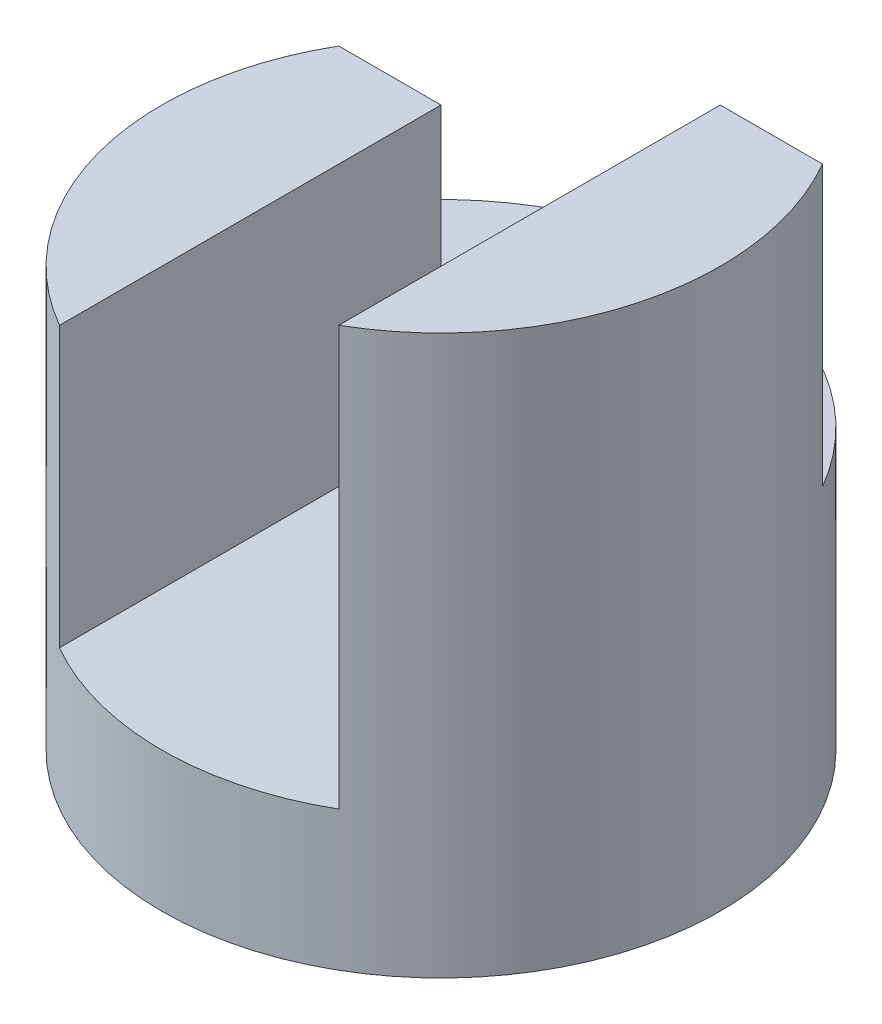
ISO-10303-21;
HEADER;
FILE_DESCRIPTION(('STEP AP214'),'2;1');
FILE_NAME('part.step','',(''),(''),'','','');
FILE_SCHEMA(('AUTOMOTIVE_DESIGN { 1 0 10303 214 1 1 1 1 }'));
ENDSEC;
DATA;
#1=APPLICATION_CONTEXT('core data for automotive mechanical design processes');
#2=APPLICATION_PROTOCOL_DEFINITION('international standard','automotive_design',2000,#1);
#3=PRODUCT_CONTEXT('',#1,'mechanical');
#4=PRODUCT('Part','Part','',(#3));
#5=PRODUCT_RELATED_PRODUCT_CATEGORY('part','',(#4));
#6=PRODUCT_DEFINITION_FORMATION('','',#4);
#7=PRODUCT_DEFINITION_CONTEXT('part definition',#1,'design');
#8=PRODUCT_DEFINITION('design','',#6,#7);
#9=PRODUCT_DEFINITION_SHAPE('','',#8);
#10=(LENGTH_UNIT() NAMED_UNIT(*) SI_UNIT(.MILLI.,.METRE.));
#11=(NAMED_UNIT(*) PLANE_ANGLE_UNIT() SI_UNIT($,.RADIAN.));
#12=(NAMED_UNIT(*) SI_UNIT($,.STERADIAN.) SOLID_ANGLE_UNIT());
#13=UNCERTAINTY_MEASURE_WITH_UNIT(LENGTH_MEASURE(1.E-05),#10,'distance_accuracy_value','');
#14=(GEOMETRIC_REPRESENTATION_CONTEXT(3) GLOBAL_UNCERTAINTY_ASSIGNED_CONTEXT((#13)) GLOBAL_UNIT_ASSIGNED_CONTEXT((#10,
#11,#12)) REPRESENTATION_CONTEXT('',''));
#15=CARTESIAN_POINT('',(0.,0.,0.));
#16=DIRECTION('',(0.,0.,1.));
#17=DIRECTION('',(1.,0.,0.));
#18=AXIS2_PLACEMENT_3D('',#15,#16,#17);
#19=CARTESIAN_POINT('',(-1.73205080756888,2.,-1.));
#20=DIRECTION('',(0.,0.,1.));
#21=DIRECTION('',(1.,0.,0.));
#22=AXIS2_PLACEMENT_3D('',#19,#20,#21);
#23=PLANE('',#22);
#24=DIRECTION('',(1.,0.,0.));
#25=VECTOR('',#24,1.);
#26=CARTESIAN_POINT('',(-1.73205080756888,2.,-1.));
#27=LINE('',#26,#25);
#28=CARTESIAN_POINT('',(1.,2.,-1.));
#29=VERTEX_POINT('',#28);
#30=CARTESIAN_POINT('',(1.73205080756888,2.,-1.));
#31=VERTEX_POINT('',#30);
#32=EDGE_CURVE('E57',#29,#31,#27,.T.);
#33=ORIENTED_EDGE('',*,*,#32,.F.);
#34=DIRECTION('',(0.,1.,0.));
#35=VECTOR('',#34,1.);
#36=CARTESIAN_POINT('',(1.,2.,-1.));
#37=LINE('',#36,#35);
#38=CARTESIAN_POINT('',(1.,4.,-1.));
#39=VERTEX_POINT('',#38);
#40=EDGE_CURVE('E118',#29,#39,#37,.T.);
#41=ORIENTED_EDGE('',*,*,#40,.T.);
#42=DIRECTION('',(1.,0.,0.));
#43=VECTOR('',#42,1.);
#44=CARTESIAN_POINT('',(-1.73205080756888,4.,-1.));
#45=LINE('',#44,#43);
#46=CARTESIAN_POINT('',(1.73205080756888,4.,-1.));
#47=VERTEX_POINT('',#46);
#48=EDGE_CURVE('E143',#39,#47,#45,.T.);
#49=ORIENTED_EDGE('',*,*,#48,.T.);
#50=DIRECTION('',(0.,1.,0.));
#51=VECTOR('',#50,1.);
#52=CARTESIAN_POINT('',(1.73205080756888,2.,-1.));
#53=LINE('',#52,#51);
#54=EDGE_CURVE('E151',#31,#47,#53,.T.);
#55=ORIENTED_EDGE('',*,*,#54,.F.);
#56=EDGE_LOOP('',(#33,#41,#49,#55));
#57=FACE_BOUND('',#56,.T.);
#58=ADVANCED_FACE('F33',(#57),#23,.F.);
#59=CARTESIAN_POINT('',(0.,4.,0.));
#60=DIRECTION('',(0.,-1.,0.));
#61=DIRECTION('',(0.,0.,-1.));
#62=AXIS2_PLACEMENT_3D('',#59,#60,#61);
#63=CYLINDRICAL_SURFACE('',#62,2.);
#64=DIRECTION('',(0.,-1.,0.));
#65=VECTOR('',#64,1.);
#66=CARTESIAN_POINT('',(1.,4.,1.73205080756888));
#67=LINE('',#66,#65);
#68=CARTESIAN_POINT('',(1.,4.,1.73205080756888));
#69=VERTEX_POINT('',#68);
#70=CARTESIAN_POINT('',(1.,1.,1.73205080756888));
#71=VERTEX_POINT('',#70);
#72=EDGE_CURVE('E140',#69,#71,#67,.T.);
#73=ORIENTED_EDGE('',*,*,#72,.T.);
#74=CARTESIAN_POINT('',(0.,1.,0.));
#75=DIRECTION('',(0.,-1.,0.));
#76=DIRECTION('',(0.,0.,-1.));
#77=AXIS2_PLACEMENT_3D('',#74,#75,#76);
#78=CIRCLE('',#77,2.);
#79=CARTESIAN_POINT('',(-1.,1.,1.73205080756888));
#80=VERTEX_POINT('',#79);
#81=EDGE_CURVE('E11',#71,#80,#78,.T.);
#82=ORIENTED_EDGE('',*,*,#81,.T.);
#83=DIRECTION('',(0.,-1.,0.));
#84=VECTOR('',#83,1.);
#85=CARTESIAN_POINT('',(-1.,4.,1.73205080756888));
#86=LINE('',#85,#84);
#87=CARTESIAN_POINT('',(-1.,3.,1.73205080756888));
#88=VERTEX_POINT('',#87);
#89=EDGE_CURVE('E137',#80,#88,#86,.F.);
#90=ORIENTED_EDGE('',*,*,#89,.T.);
#91=CARTESIAN_POINT('',(0.,3.,0.));
#92=DIRECTION('',(0.,-1.,0.));
#93=DIRECTION('',(0.,0.,-1.));
#94=AXIS2_PLACEMENT_3D('',#91,#92,#93);
#95=CIRCLE('',#94,2.);
#96=CARTESIAN_POINT('',(-1.73205080756888,3.,-1.));
#97=VERTEX_POINT('',#96);
#98=EDGE_CURVE('E75',#88,#97,#95,.T.);
#99=ORIENTED_EDGE('',*,*,#98,.T.);
#100=DIRECTION('',(0.,1.,0.));
#101=VECTOR('',#100,1.);
#102=CARTESIAN_POINT('',(-1.73205080756888,2.,-1.));
#103=LINE('',#102,#101);
#104=CARTESIAN_POINT('',(-1.73205080756888,2.,-1.));
#105=VERTEX_POINT('',#104);
#106=EDGE_CURVE('E149',#105,#97,#103,.T.);
#107=ORIENTED_EDGE('',*,*,#106,.F.);
#108=CARTESIAN_POINT('',(0.,2.,0.));
#109=DIRECTION('',(0.,1.,0.));
#110=DIRECTION('',(0.,0.,-1.));
#111=AXIS2_PLACEMENT_3D('',#108,#109,#110);
#112=CIRCLE('',#111,2.);
#113=EDGE_CURVE('E144',#31,#105,#112,.T.);
#114=ORIENTED_EDGE('',*,*,#113,.F.);
#115=ORIENTED_EDGE('',*,*,#54,.T.);
#116=CARTESIAN_POINT('',(0.,4.,0.));
#117=DIRECTION('',(0.,1.,0.));
#118=DIRECTION('',(0.,0.,1.));
#119=AXIS2_PLACEMENT_3D('',#116,#117,#118);
#120=CIRCLE('',#119,2.);
#121=EDGE_CURVE('E68',#69,#47,#120,.T.);
#122=ORIENTED_EDGE('',*,*,#121,.F.);
#123=EDGE_LOOP('',(#73,#82,#90,#99,#107,#114,#115,#122));
#124=FACE_BOUND('',#123,.T.);
#125=CARTESIAN_POINT('',(0.,0.,0.));
#126=DIRECTION('',(0.,1.,0.));
#127=DIRECTION('',(0.,0.,1.));
#128=AXIS2_PLACEMENT_3D('',#125,#126,#127);
#129=CIRCLE('',#128,2.);
#130=CARTESIAN_POINT('',(0.,0.,2.));
#131=VERTEX_POINT('',#130);
#132=EDGE_CURVE('E154',#131,#131,#129,.T.);
#133=ORIENTED_EDGE('',*,*,#132,.T.);
#134=EDGE_LOOP('',(#133));
#135=FACE_BOUND('',#134,.T.);
#136=ADVANCED_FACE('F35',(#124,#135),#63,.T.);
#137=CARTESIAN_POINT('',(0.,4.,0.));
#138=DIRECTION('',(0.,1.,0.));
#139=DIRECTION('',(0.,0.,1.));
#140=AXIS2_PLACEMENT_3D('',#137,#138,#139);
#141=PLANE('',#140);
#142=DIRECTION('',(0.,0.,1.));
#143=VECTOR('',#142,1.);
#144=CARTESIAN_POINT('',(1.,4.,-5.5));
#145=LINE('',#144,#143);
#146=EDGE_CURVE('E131',#39,#69,#145,.T.);
#147=ORIENTED_EDGE('',*,*,#146,.T.);
#148=ORIENTED_EDGE('',*,*,#121,.T.);
#149=ORIENTED_EDGE('',*,*,#48,.F.);
#150=EDGE_LOOP('',(#147,#148,#149));
#151=FACE_BOUND('',#150,.T.);
#152=ADVANCED_FACE('F167',(#151),#141,.T.);
#153=CARTESIAN_POINT('',(0.,0.,0.));
#154=DIRECTION('',(0.,1.,0.));
#155=DIRECTION('',(0.,0.,1.));
#156=AXIS2_PLACEMENT_3D('',#153,#154,#155);
#157=PLANE('',#156);
#158=ORIENTED_EDGE('',*,*,#132,.F.);
#159=EDGE_LOOP('',(#158));
#160=FACE_BOUND('',#159,.T.);
#161=ADVANCED_FACE('F178',(#160),#157,.F.);
#162=DIRECTION('',(1.,0.,0.));
#163=VECTOR('',#162,1.);
#164=CARTESIAN_POINT('',(-1.73205080756888,3.,-1.));
#165=LINE('',#164,#163);
#166=CARTESIAN_POINT('',(-1.,3.,-1.));
#167=VERTEX_POINT('',#166);
#168=EDGE_CURVE('E41',#97,#167,#165,.T.);
#169=ORIENTED_EDGE('',*,*,#168,.T.);
#170=DIRECTION('',(0.,-1.,0.));
#171=VECTOR('',#170,1.);
#172=CARTESIAN_POINT('',(-1.,2.,-1.));
#173=LINE('',#172,#171);
#174=CARTESIAN_POINT('',(-1.,2.,-1.));
#175=VERTEX_POINT('',#174);
#176=EDGE_CURVE('E133',#167,#175,#173,.T.);
#177=ORIENTED_EDGE('',*,*,#176,.T.);
#178=EDGE_CURVE('E146',#105,#175,#27,.T.);
#179=ORIENTED_EDGE('',*,*,#178,.F.);
#180=ORIENTED_EDGE('',*,*,#106,.T.);
#181=EDGE_LOOP('',(#169,#177,#179,#180));
#182=FACE_BOUND('',#181,.T.);
#183=ADVANCED_FACE('F161',(#182),#23,.F.);
#184=CARTESIAN_POINT('',(0.,2.,0.));
#185=DIRECTION('',(0.,-1.,0.));
#186=DIRECTION('',(0.,0.,-1.));
#187=AXIS2_PLACEMENT_3D('',#184,#185,#186);
#188=PLANE('',#187);
#189=ORIENTED_EDGE('',*,*,#178,.T.);
#190=DIRECTION('',(-1.,0.,0.));
#191=VECTOR('',#190,1.);
#192=CARTESIAN_POINT('',(1.,2.,-1.));
#193=LINE('',#192,#191);
#194=EDGE_CURVE('E112',#29,#175,#193,.T.);
#195=ORIENTED_EDGE('',*,*,#194,.F.);
#196=ORIENTED_EDGE('',*,*,#32,.T.);
#197=ORIENTED_EDGE('',*,*,#113,.T.);
#198=EDGE_LOOP('',(#189,#195,#196,#197));
#199=FACE_BOUND('',#198,.T.);
#200=ADVANCED_FACE('F170',(#199),#188,.F.);
#201=CARTESIAN_POINT('',(-2.,3.,-5.5));
#202=DIRECTION('',(0.,-1.,0.));
#203=DIRECTION('',(0.,0.,-1.));
#204=AXIS2_PLACEMENT_3D('',#201,#202,#203);
#205=PLANE('',#204);
#206=DIRECTION('',(0.,0.,1.));
#207=VECTOR('',#206,1.);
#208=CARTESIAN_POINT('',(-1.,3.,-5.5));
#209=LINE('',#208,#207);
#210=EDGE_CURVE('E48',#167,#88,#209,.T.);
#211=ORIENTED_EDGE('',*,*,#210,.F.);
#212=ORIENTED_EDGE('',*,*,#168,.F.);
#213=ORIENTED_EDGE('',*,*,#98,.F.);
#214=EDGE_LOOP('',(#211,#212,#213));
#215=FACE_BOUND('',#214,.T.);
#216=ADVANCED_FACE('F163',(#215),#205,.F.);
#217=CARTESIAN_POINT('',(1.,2.,-5.5));
#218=DIRECTION('',(1.,0.,0.));
#219=DIRECTION('',(0.,0.,-1.));
#220=AXIS2_PLACEMENT_3D('',#217,#218,#219);
#221=PLANE('',#220);
#222=ORIENTED_EDGE('',*,*,#146,.F.);
#223=ORIENTED_EDGE('',*,*,#40,.F.);
#224=DIRECTION('',(0.,1.,0.));
#225=VECTOR('',#224,1.);
#226=CARTESIAN_POINT('',(1.,1.,-1.));
#227=LINE('',#226,#225);
#228=CARTESIAN_POINT('',(1.,1.,-1.));
#229=VERTEX_POINT('',#228);
#230=EDGE_CURVE('E115',#229,#29,#227,.T.);
#231=ORIENTED_EDGE('',*,*,#230,.F.);
#232=DIRECTION('',(0.,0.,-1.));
#233=VECTOR('',#232,1.);
#234=CARTESIAN_POINT('',(1.,1.,-1.));
#235=LINE('',#234,#233);
#236=EDGE_CURVE('E105',#71,#229,#235,.T.);
#237=ORIENTED_EDGE('',*,*,#236,.F.);
#238=ORIENTED_EDGE('',*,*,#72,.F.);
#239=EDGE_LOOP('',(#222,#223,#231,#237,#238));
#240=FACE_BOUND('',#239,.T.);
#241=ADVANCED_FACE('F116',(#240),#221,.F.);
#242=CARTESIAN_POINT('',(-1.,3.,-5.5));
#243=DIRECTION('',(-1.,0.,0.));
#244=DIRECTION('',(0.,0.,1.));
#245=AXIS2_PLACEMENT_3D('',#242,#243,#244);
#246=PLANE('',#245);
#247=ORIENTED_EDGE('',*,*,#89,.F.);
#248=DIRECTION('',(0.,0.,1.));
#249=VECTOR('',#248,1.);
#250=CARTESIAN_POINT('',(-1.,1.,-1.));
#251=LINE('',#250,#249);
#252=CARTESIAN_POINT('',(-1.,1.,-1.));
#253=VERTEX_POINT('',#252);
#254=EDGE_CURVE('E121',#253,#80,#251,.T.);
#255=ORIENTED_EDGE('',*,*,#254,.F.);
#256=DIRECTION('',(0.,1.,0.));
#257=VECTOR('',#256,1.);
#258=CARTESIAN_POINT('',(-1.,1.,-1.));
#259=LINE('',#258,#257);
#260=EDGE_CURVE('E120',#253,#175,#259,.T.);
#261=ORIENTED_EDGE('',*,*,#260,.T.);
#262=ORIENTED_EDGE('',*,*,#176,.F.);
#263=ORIENTED_EDGE('',*,*,#210,.T.);
#264=EDGE_LOOP('',(#247,#255,#261,#262,#263));
#265=FACE_BOUND('',#264,.T.);
#266=ADVANCED_FACE('F165',(#265),#246,.F.);
#267=CARTESIAN_POINT('',(0.,1.,0.));
#268=DIRECTION('',(0.,-1.,0.));
#269=DIRECTION('',(0.,0.,-1.));
#270=AXIS2_PLACEMENT_3D('',#267,#268,#269);
#271=PLANE('',#270);
#272=ORIENTED_EDGE('',*,*,#236,.T.);
#273=DIRECTION('',(-1.,0.,0.));
#274=VECTOR('',#273,1.);
#275=CARTESIAN_POINT('',(1.,1.,-1.));
#276=LINE('',#275,#274);
#277=EDGE_CURVE('E110',#229,#253,#276,.T.);
#278=ORIENTED_EDGE('',*,*,#277,.T.);
#279=ORIENTED_EDGE('',*,*,#254,.T.);
#280=ORIENTED_EDGE('',*,*,#81,.F.);
#281=EDGE_LOOP('',(#272,#278,#279,#280));
#282=FACE_BOUND('',#281,.T.);
#283=ADVANCED_FACE('F107',(#282),#271,.F.);
#284=CARTESIAN_POINT('',(1.,1.,-1.));
#285=DIRECTION('',(0.,0.,-1.));
#286=DIRECTION('',(-1.,0.,0.));
#287=AXIS2_PLACEMENT_3D('',#284,#285,#286);
#288=PLANE('',#287);
#289=ORIENTED_EDGE('',*,*,#194,.T.);
#290=ORIENTED_EDGE('',*,*,#260,.F.);
#291=ORIENTED_EDGE('',*,*,#277,.F.);
#292=ORIENTED_EDGE('',*,*,#230,.T.);
#293=EDGE_LOOP('',(#289,#290,#291,#292));
#294=FACE_BOUND('',#293,.T.);
#295=ADVANCED_FACE('F123',(#294),#288,.F.);
#296=CLOSED_SHELL('',(#58,#136,#152,#161,#183,#200,#216,#241,#266,#283,#295));
#297=MANIFOLD_SOLID_BREP('B2',#296);
#298=ADVANCED_BREP_SHAPE_REPRESENTATION('',(#18,#297),#14);
#299=SHAPE_DEFINITION_REPRESENTATION(#9,#298);
ENDSEC;
END-ISO-10303-21;
